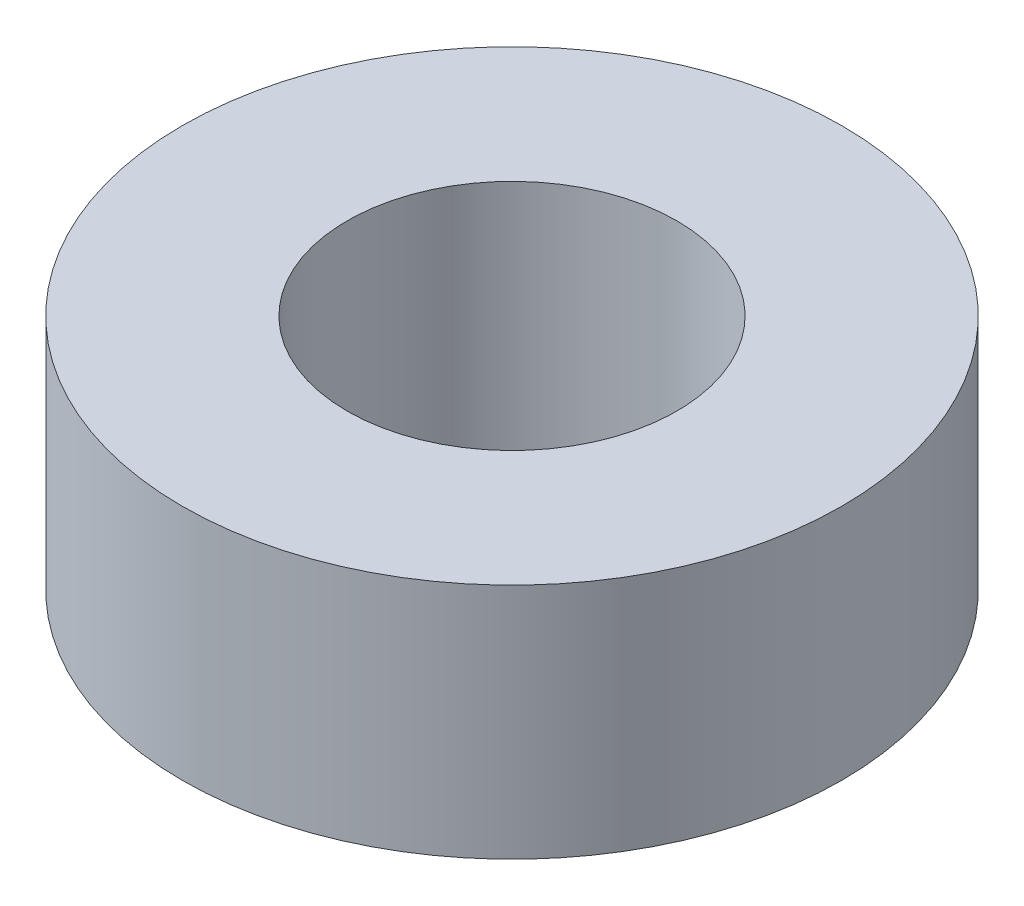
ISO-10303-21;
HEADER;
FILE_DESCRIPTION(('STEP AP214'),'2;1');
FILE_NAME('part.step','',(''),(''),'','','');
FILE_SCHEMA(('AUTOMOTIVE_DESIGN { 1 0 10303 214 1 1 1 1 }'));
ENDSEC;
DATA;
#1=APPLICATION_CONTEXT('core data for automotive mechanical design processes');
#2=APPLICATION_PROTOCOL_DEFINITION('international standard','automotive_design',2000,#1);
#3=PRODUCT_CONTEXT('',#1,'mechanical');
#4=PRODUCT('Part','Part','',(#3));
#5=PRODUCT_RELATED_PRODUCT_CATEGORY('part','',(#4));
#6=PRODUCT_DEFINITION_FORMATION('','',#4);
#7=PRODUCT_DEFINITION_CONTEXT('part definition',#1,'design');
#8=PRODUCT_DEFINITION('design','',#6,#7);
#9=PRODUCT_DEFINITION_SHAPE('','',#8);
#10=(LENGTH_UNIT() NAMED_UNIT(*) SI_UNIT(.MILLI.,.METRE.));
#11=(NAMED_UNIT(*) PLANE_ANGLE_UNIT() SI_UNIT($,.RADIAN.));
#12=(NAMED_UNIT(*) SI_UNIT($,.STERADIAN.) SOLID_ANGLE_UNIT());
#13=UNCERTAINTY_MEASURE_WITH_UNIT(LENGTH_MEASURE(1.E-05),#10,'distance_accuracy_value','');
#14=(GEOMETRIC_REPRESENTATION_CONTEXT(3) GLOBAL_UNCERTAINTY_ASSIGNED_CONTEXT((#13)) GLOBAL_UNIT_ASSIGNED_CONTEXT((#10,
#11,#12)) REPRESENTATION_CONTEXT('',''));
#15=CARTESIAN_POINT('',(0.,0.,0.));
#16=DIRECTION('',(0.,0.,1.));
#17=DIRECTION('',(1.,0.,0.));
#18=AXIS2_PLACEMENT_3D('',#15,#16,#17);
#19=CARTESIAN_POINT('',(0.,9.,0.));
#20=DIRECTION('',(0.,1.,0.));
#21=DIRECTION('',(0.,0.,1.));
#22=AXIS2_PLACEMENT_3D('',#19,#20,#21);
#23=PLANE('',#22);
#24=CARTESIAN_POINT('',(0.,9.,0.));
#25=DIRECTION('',(0.,1.,0.));
#26=DIRECTION('',(0.,0.,1.));
#27=AXIS2_PLACEMENT_3D('',#24,#25,#26);
#28=CIRCLE('',#27,12.5);
#29=CARTESIAN_POINT('',(0.,9.,12.5));
#30=VERTEX_POINT('',#29);
#31=EDGE_CURVE('E10',#30,#30,#28,.T.);
#32=ORIENTED_EDGE('',*,*,#31,.T.);
#33=EDGE_LOOP('',(#32));
#34=FACE_BOUND('',#33,.T.);
#35=CARTESIAN_POINT('',(0.,9.,0.));
#36=DIRECTION('',(0.,1.,0.));
#37=DIRECTION('',(0.,0.,1.));
#38=AXIS2_PLACEMENT_3D('',#35,#36,#37);
#39=CIRCLE('',#38,6.25);
#40=CARTESIAN_POINT('',(0.,9.,6.25));
#41=VERTEX_POINT('',#40);
#42=EDGE_CURVE('E50',#41,#41,#39,.T.);
#43=ORIENTED_EDGE('',*,*,#42,.F.);
#44=EDGE_LOOP('',(#43));
#45=FACE_BOUND('',#44,.T.);
#46=ADVANCED_FACE('F37',(#34,#45),#23,.T.);
#47=CARTESIAN_POINT('',(0.,0.,0.));
#48=DIRECTION('',(0.,1.,0.));
#49=DIRECTION('',(0.,0.,1.));
#50=AXIS2_PLACEMENT_3D('',#47,#48,#49);
#51=PLANE('',#50);
#52=CARTESIAN_POINT('',(0.,0.,0.));
#53=DIRECTION('',(0.,1.,0.));
#54=DIRECTION('',(0.,0.,1.));
#55=AXIS2_PLACEMENT_3D('',#52,#53,#54);
#56=CIRCLE('',#55,12.5);
#57=CARTESIAN_POINT('',(0.,0.,12.5));
#58=VERTEX_POINT('',#57);
#59=EDGE_CURVE('E41',#58,#58,#56,.T.);
#60=ORIENTED_EDGE('',*,*,#59,.F.);
#61=EDGE_LOOP('',(#60));
#62=FACE_BOUND('',#61,.T.);
#63=CARTESIAN_POINT('',(0.,0.,0.));
#64=DIRECTION('',(0.,1.,0.));
#65=DIRECTION('',(0.,0.,1.));
#66=AXIS2_PLACEMENT_3D('',#63,#64,#65);
#67=CIRCLE('',#66,6.25);
#68=CARTESIAN_POINT('',(0.,0.,6.25));
#69=VERTEX_POINT('',#68);
#70=EDGE_CURVE('E52',#69,#69,#67,.T.);
#71=ORIENTED_EDGE('',*,*,#70,.T.);
#72=EDGE_LOOP('',(#71));
#73=FACE_BOUND('',#72,.T.);
#74=ADVANCED_FACE('F64',(#62,#73),#51,.F.);
#75=CARTESIAN_POINT('',(0.,9.,0.));
#76=DIRECTION('',(0.,-1.,0.));
#77=DIRECTION('',(0.,0.,-1.));
#78=AXIS2_PLACEMENT_3D('',#75,#76,#77);
#79=CYLINDRICAL_SURFACE('',#78,12.5);
#80=ORIENTED_EDGE('',*,*,#31,.F.);
#81=EDGE_LOOP('',(#80));
#82=FACE_BOUND('',#81,.T.);
#83=ORIENTED_EDGE('',*,*,#59,.T.);
#84=EDGE_LOOP('',(#83));
#85=FACE_BOUND('',#84,.T.);
#86=ADVANCED_FACE('F39',(#82,#85),#79,.T.);
#87=CARTESIAN_POINT('',(0.,9.,0.));
#88=DIRECTION('',(0.,-1.,0.));
#89=DIRECTION('',(0.,0.,-1.));
#90=AXIS2_PLACEMENT_3D('',#87,#88,#89);
#91=CYLINDRICAL_SURFACE('',#90,6.25);
#92=ORIENTED_EDGE('',*,*,#42,.T.);
#93=EDGE_LOOP('',(#92));
#94=FACE_BOUND('',#93,.T.);
#95=ORIENTED_EDGE('',*,*,#70,.F.);
#96=EDGE_LOOP('',(#95));
#97=FACE_BOUND('',#96,.T.);
#98=ADVANCED_FACE('F60',(#94,#97),#91,.F.);
#99=CLOSED_SHELL('',(#46,#74,#86,#98));
#100=MANIFOLD_SOLID_BREP('B2',#99);
#101=ADVANCED_BREP_SHAPE_REPRESENTATION('',(#18,#100),#14);
#102=SHAPE_DEFINITION_REPRESENTATION(#9,#101);
ENDSEC;
END-ISO-10303-21;
